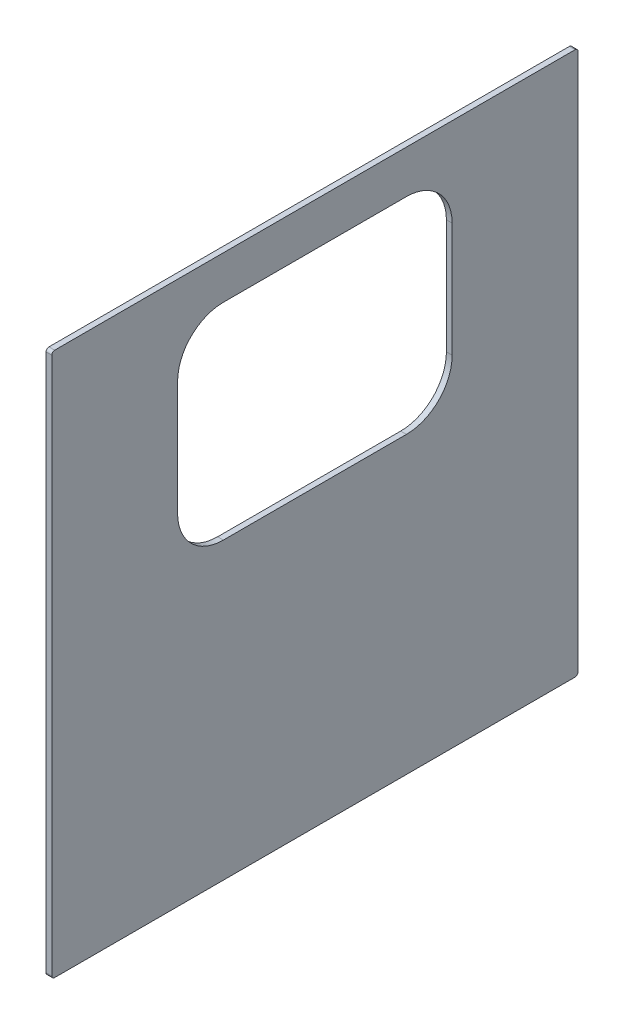
ISO-10303-21;
HEADER;
FILE_DESCRIPTION(('STEP AP214'),'2;1');
FILE_NAME('part.step','',(''),(''),'','','');
FILE_SCHEMA(('AUTOMOTIVE_DESIGN { 1 0 10303 214 1 1 1 1 }'));
ENDSEC;
DATA;
#1=APPLICATION_CONTEXT('core data for automotive mechanical design processes');
#2=APPLICATION_PROTOCOL_DEFINITION('international standard','automotive_design',2000,#1);
#3=PRODUCT_CONTEXT('',#1,'mechanical');
#4=PRODUCT('Part','Part','',(#3));
#5=PRODUCT_RELATED_PRODUCT_CATEGORY('part','',(#4));
#6=PRODUCT_DEFINITION_FORMATION('','',#4);
#7=PRODUCT_DEFINITION_CONTEXT('part definition',#1,'design');
#8=PRODUCT_DEFINITION('design','',#6,#7);
#9=PRODUCT_DEFINITION_SHAPE('','',#8);
#10=(LENGTH_UNIT() NAMED_UNIT(*) SI_UNIT(.MILLI.,.METRE.));
#11=(NAMED_UNIT(*) PLANE_ANGLE_UNIT() SI_UNIT($,.RADIAN.));
#12=(NAMED_UNIT(*) SI_UNIT($,.STERADIAN.) SOLID_ANGLE_UNIT());
#13=UNCERTAINTY_MEASURE_WITH_UNIT(LENGTH_MEASURE(1.E-05),#10,'distance_accuracy_value','');
#14=(GEOMETRIC_REPRESENTATION_CONTEXT(3) GLOBAL_UNCERTAINTY_ASSIGNED_CONTEXT((#13)) GLOBAL_UNIT_ASSIGNED_CONTEXT((#10,
#11,#12)) REPRESENTATION_CONTEXT('',''));
#15=CARTESIAN_POINT('',(0.,0.,0.));
#16=DIRECTION('',(0.,0.,1.));
#17=DIRECTION('',(1.,0.,0.));
#18=AXIS2_PLACEMENT_3D('',#15,#16,#17);
#19=CARTESIAN_POINT('',(12.7,6.35,-6.35));
#20=DIRECTION('',(1.,0.,0.));
#21=DIRECTION('',(0.,0.,-1.));
#22=AXIS2_PLACEMENT_3D('',#19,#20,#21);
#23=PLANE('',#22);
#24=CARTESIAN_POINT('',(12.7,6.35,-6.35));
#25=DIRECTION('',(1.,0.,0.));
#26=DIRECTION('',(0.,0.,-1.));
#27=AXIS2_PLACEMENT_3D('',#24,#25,#26);
#28=CIRCLE('',#27,6.35);
#29=CARTESIAN_POINT('',(12.7,6.35000000000004,0.));
#30=VERTEX_POINT('',#29);
#31=CARTESIAN_POINT('',(12.7,0.,-6.35000000000004));
#32=VERTEX_POINT('',#31);
#33=EDGE_CURVE('E278',#30,#32,#28,.T.);
#34=ORIENTED_EDGE('',*,*,#33,.T.);
#35=DIRECTION('',(0.,0.,-1.));
#36=VECTOR('',#35,1.);
#37=CARTESIAN_POINT('',(12.7,0.,-6.35000000000004));
#38=LINE('',#37,#36);
#39=CARTESIAN_POINT('',(12.7,0.,-1162.05));
#40=VERTEX_POINT('',#39);
#41=EDGE_CURVE('E282',#32,#40,#38,.T.);
#42=ORIENTED_EDGE('',*,*,#41,.T.);
#43=CARTESIAN_POINT('',(12.7,6.35,-1162.05));
#44=DIRECTION('',(1.,0.,0.));
#45=DIRECTION('',(0.,0.,-1.));
#46=AXIS2_PLACEMENT_3D('',#43,#44,#45);
#47=CIRCLE('',#46,6.34999999999993);
#48=CARTESIAN_POINT('',(12.7,6.35,-1168.4));
#49=VERTEX_POINT('',#48);
#50=EDGE_CURVE('E286',#40,#49,#47,.T.);
#51=ORIENTED_EDGE('',*,*,#50,.T.);
#52=DIRECTION('',(0.,1.,0.));
#53=VECTOR('',#52,1.);
#54=CARTESIAN_POINT('',(12.7,6.35,-1168.4));
#55=LINE('',#54,#53);
#56=CARTESIAN_POINT('',(12.7,1200.15,-1168.4));
#57=VERTEX_POINT('',#56);
#58=EDGE_CURVE('E289',#49,#57,#55,.T.);
#59=ORIENTED_EDGE('',*,*,#58,.T.);
#60=CARTESIAN_POINT('',(12.7,1200.15,-1162.05));
#61=DIRECTION('',(1.,0.,0.));
#62=DIRECTION('',(0.,0.,-1.));
#63=AXIS2_PLACEMENT_3D('',#60,#61,#62);
#64=CIRCLE('',#63,6.34999999999997);
#65=CARTESIAN_POINT('',(12.7,1206.5,-1162.05));
#66=VERTEX_POINT('',#65);
#67=EDGE_CURVE('E292',#57,#66,#64,.T.);
#68=ORIENTED_EDGE('',*,*,#67,.T.);
#69=DIRECTION('',(0.,0.,1.));
#70=VECTOR('',#69,1.);
#71=CARTESIAN_POINT('',(12.7,1206.5,-6.35));
#72=LINE('',#71,#70);
#73=CARTESIAN_POINT('',(12.7,1206.5,-6.35));
#74=VERTEX_POINT('',#73);
#75=EDGE_CURVE('E295',#66,#74,#72,.T.);
#76=ORIENTED_EDGE('',*,*,#75,.T.);
#77=CARTESIAN_POINT('',(12.7,1200.15,-6.35));
#78=DIRECTION('',(1.,0.,0.));
#79=DIRECTION('',(0.,0.,-1.));
#80=AXIS2_PLACEMENT_3D('',#77,#78,#79);
#81=CIRCLE('',#80,6.35000000000004);
#82=CARTESIAN_POINT('',(12.7,1200.15,0.));
#83=VERTEX_POINT('',#82);
#84=EDGE_CURVE('E298',#74,#83,#81,.T.);
#85=ORIENTED_EDGE('',*,*,#84,.T.);
#86=DIRECTION('',(0.,-1.,0.));
#87=VECTOR('',#86,1.);
#88=CARTESIAN_POINT('',(12.7,6.35000000000004,0.));
#89=LINE('',#88,#87);
#90=EDGE_CURVE('E301',#83,#30,#89,.T.);
#91=ORIENTED_EDGE('',*,*,#90,.T.);
#92=EDGE_LOOP('',(#34,#42,#51,#59,#68,#76,#85,#91));
#93=FACE_BOUND('',#92,.T.);
#94=DIRECTION('',(0.,0.,-1.));
#95=VECTOR('',#94,1.);
#96=CARTESIAN_POINT('',(12.7,654.05,-381.));
#97=LINE('',#96,#95);
#98=CARTESIAN_POINT('',(12.7,654.05,-381.));
#99=VERTEX_POINT('',#98);
#100=CARTESIAN_POINT('',(12.7,654.05,-787.4));
#101=VERTEX_POINT('',#100);
#102=EDGE_CURVE('E198',#99,#101,#97,.T.);
#103=ORIENTED_EDGE('',*,*,#102,.F.);
#104=CARTESIAN_POINT('',(12.7,755.65,-381.));
#105=DIRECTION('',(1.,0.,0.));
#106=DIRECTION('',(0.,0.,-1.));
#107=AXIS2_PLACEMENT_3D('',#104,#105,#106);
#108=CIRCLE('',#107,101.6);
#109=CARTESIAN_POINT('',(12.7,755.65,-279.4));
#110=VERTEX_POINT('',#109);
#111=EDGE_CURVE('E189',#110,#99,#108,.T.);
#112=ORIENTED_EDGE('',*,*,#111,.F.);
#113=DIRECTION('',(0.,-1.,0.));
#114=VECTOR('',#113,1.);
#115=CARTESIAN_POINT('',(12.7,1009.65,-279.4));
#116=LINE('',#115,#114);
#117=CARTESIAN_POINT('',(12.7,1009.65,-279.4));
#118=VERTEX_POINT('',#117);
#119=EDGE_CURVE('E231',#118,#110,#116,.T.);
#120=ORIENTED_EDGE('',*,*,#119,.F.);
#121=CARTESIAN_POINT('',(12.7,1009.65,-381.));
#122=DIRECTION('',(1.,0.,0.));
#123=DIRECTION('',(0.,0.,1.));
#124=AXIS2_PLACEMENT_3D('',#121,#122,#123);
#125=CIRCLE('',#124,101.6);
#126=CARTESIAN_POINT('',(12.7,1111.25,-381.));
#127=VERTEX_POINT('',#126);
#128=EDGE_CURVE('E228',#127,#118,#125,.T.);
#129=ORIENTED_EDGE('',*,*,#128,.F.);
#130=DIRECTION('',(0.,0.,1.));
#131=VECTOR('',#130,1.);
#132=CARTESIAN_POINT('',(12.7,1111.25,-381.));
#133=LINE('',#132,#131);
#134=CARTESIAN_POINT('',(12.7,1111.25,-787.4));
#135=VERTEX_POINT('',#134);
#136=EDGE_CURVE('E225',#135,#127,#133,.T.);
#137=ORIENTED_EDGE('',*,*,#136,.F.);
#138=CARTESIAN_POINT('',(12.7,1009.65,-787.4));
#139=DIRECTION('',(1.,0.,0.));
#140=DIRECTION('',(0.,0.,1.));
#141=AXIS2_PLACEMENT_3D('',#138,#139,#140);
#142=CIRCLE('',#141,101.6);
#143=CARTESIAN_POINT('',(12.7,1009.65,-889.));
#144=VERTEX_POINT('',#143);
#145=EDGE_CURVE('E222',#144,#135,#142,.T.);
#146=ORIENTED_EDGE('',*,*,#145,.F.);
#147=DIRECTION('',(0.,1.,0.));
#148=VECTOR('',#147,1.);
#149=CARTESIAN_POINT('',(12.7,1009.65,-889.));
#150=LINE('',#149,#148);
#151=CARTESIAN_POINT('',(12.7,755.65,-889.));
#152=VERTEX_POINT('',#151);
#153=EDGE_CURVE('E217',#152,#144,#150,.T.);
#154=ORIENTED_EDGE('',*,*,#153,.F.);
#155=CARTESIAN_POINT('',(12.7,755.65,-787.4));
#156=DIRECTION('',(1.,0.,0.));
#157=DIRECTION('',(0.,0.,1.));
#158=AXIS2_PLACEMENT_3D('',#155,#156,#157);
#159=CIRCLE('',#158,101.6);
#160=EDGE_CURVE('E212',#101,#152,#159,.T.);
#161=ORIENTED_EDGE('',*,*,#160,.F.);
#162=EDGE_LOOP('',(#103,#112,#120,#129,#137,#146,#154,#161));
#163=FACE_BOUND('',#162,.T.);
#164=ADVANCED_FACE('F39',(#93,#163),#23,.T.);
#165=CARTESIAN_POINT('',(0.,6.35,-6.35));
#166=DIRECTION('',(1.,0.,0.));
#167=DIRECTION('',(0.,0.,-1.));
#168=AXIS2_PLACEMENT_3D('',#165,#166,#167);
#169=PLANE('',#168);
#170=CARTESIAN_POINT('',(0.,6.35,-6.35));
#171=DIRECTION('',(1.,0.,0.));
#172=DIRECTION('',(0.,0.,-1.));
#173=AXIS2_PLACEMENT_3D('',#170,#171,#172);
#174=CIRCLE('',#173,6.35);
#175=CARTESIAN_POINT('',(0.,6.35000000000004,0.));
#176=VERTEX_POINT('',#175);
#177=CARTESIAN_POINT('',(0.,0.,-6.35000000000004));
#178=VERTEX_POINT('',#177);
#179=EDGE_CURVE('E207',#176,#178,#174,.T.);
#180=ORIENTED_EDGE('',*,*,#179,.F.);
#181=DIRECTION('',(0.,-1.,0.));
#182=VECTOR('',#181,1.);
#183=CARTESIAN_POINT('',(0.,6.35000000000004,0.));
#184=LINE('',#183,#182);
#185=CARTESIAN_POINT('',(0.,1200.15,0.));
#186=VERTEX_POINT('',#185);
#187=EDGE_CURVE('E283',#186,#176,#184,.T.);
#188=ORIENTED_EDGE('',*,*,#187,.F.);
#189=CARTESIAN_POINT('',(0.,1200.15,-6.35));
#190=DIRECTION('',(1.,0.,0.));
#191=DIRECTION('',(0.,0.,-1.));
#192=AXIS2_PLACEMENT_3D('',#189,#190,#191);
#193=CIRCLE('',#192,6.35000000000004);
#194=CARTESIAN_POINT('',(0.,1206.5,-6.35));
#195=VERTEX_POINT('',#194);
#196=EDGE_CURVE('E323',#195,#186,#193,.T.);
#197=ORIENTED_EDGE('',*,*,#196,.F.);
#198=DIRECTION('',(0.,0.,1.));
#199=VECTOR('',#198,1.);
#200=CARTESIAN_POINT('',(0.,1206.5,-6.35));
#201=LINE('',#200,#199);
#202=CARTESIAN_POINT('',(0.,1206.5,-1162.05));
#203=VERTEX_POINT('',#202);
#204=EDGE_CURVE('E320',#203,#195,#201,.T.);
#205=ORIENTED_EDGE('',*,*,#204,.F.);
#206=CARTESIAN_POINT('',(0.,1200.15,-1162.05));
#207=DIRECTION('',(1.,0.,0.));
#208=DIRECTION('',(0.,0.,-1.));
#209=AXIS2_PLACEMENT_3D('',#206,#207,#208);
#210=CIRCLE('',#209,6.34999999999997);
#211=CARTESIAN_POINT('',(0.,1200.15,-1168.4));
#212=VERTEX_POINT('',#211);
#213=EDGE_CURVE('E317',#212,#203,#210,.T.);
#214=ORIENTED_EDGE('',*,*,#213,.F.);
#215=DIRECTION('',(0.,1.,0.));
#216=VECTOR('',#215,1.);
#217=CARTESIAN_POINT('',(0.,6.35,-1168.4));
#218=LINE('',#217,#216);
#219=CARTESIAN_POINT('',(0.,6.35,-1168.4));
#220=VERTEX_POINT('',#219);
#221=EDGE_CURVE('E314',#220,#212,#218,.T.);
#222=ORIENTED_EDGE('',*,*,#221,.F.);
#223=CARTESIAN_POINT('',(0.,6.35,-1162.05));
#224=DIRECTION('',(1.,0.,0.));
#225=DIRECTION('',(0.,0.,-1.));
#226=AXIS2_PLACEMENT_3D('',#223,#224,#225);
#227=CIRCLE('',#226,6.34999999999993);
#228=CARTESIAN_POINT('',(0.,0.,-1162.05));
#229=VERTEX_POINT('',#228);
#230=EDGE_CURVE('E311',#229,#220,#227,.T.);
#231=ORIENTED_EDGE('',*,*,#230,.F.);
#232=DIRECTION('',(0.,0.,-1.));
#233=VECTOR('',#232,1.);
#234=CARTESIAN_POINT('',(0.,0.,-6.35000000000004));
#235=LINE('',#234,#233);
#236=EDGE_CURVE('E308',#178,#229,#235,.T.);
#237=ORIENTED_EDGE('',*,*,#236,.F.);
#238=EDGE_LOOP('',(#180,#188,#197,#205,#214,#222,#231,#237));
#239=FACE_BOUND('',#238,.T.);
#240=CARTESIAN_POINT('',(0.,755.65,-381.));
#241=DIRECTION('',(1.,0.,0.));
#242=DIRECTION('',(0.,0.,-1.));
#243=AXIS2_PLACEMENT_3D('',#240,#241,#242);
#244=CIRCLE('',#243,101.6);
#245=CARTESIAN_POINT('',(0.,755.65,-279.4));
#246=VERTEX_POINT('',#245);
#247=CARTESIAN_POINT('',(0.,654.05,-381.));
#248=VERTEX_POINT('',#247);
#249=EDGE_CURVE('E69',#246,#248,#244,.T.);
#250=ORIENTED_EDGE('',*,*,#249,.T.);
#251=DIRECTION('',(0.,0.,-1.));
#252=VECTOR('',#251,1.);
#253=CARTESIAN_POINT('',(0.,654.05,-381.));
#254=LINE('',#253,#252);
#255=CARTESIAN_POINT('',(0.,654.05,-787.4));
#256=VERTEX_POINT('',#255);
#257=EDGE_CURVE('E205',#248,#256,#254,.T.);
#258=ORIENTED_EDGE('',*,*,#257,.T.);
#259=CARTESIAN_POINT('',(0.,755.65,-787.4));
#260=DIRECTION('',(1.,0.,0.));
#261=DIRECTION('',(0.,0.,1.));
#262=AXIS2_PLACEMENT_3D('',#259,#260,#261);
#263=CIRCLE('',#262,101.6);
#264=CARTESIAN_POINT('',(0.,755.65,-889.));
#265=VERTEX_POINT('',#264);
#266=EDGE_CURVE('E237',#256,#265,#263,.T.);
#267=ORIENTED_EDGE('',*,*,#266,.T.);
#268=DIRECTION('',(0.,1.,0.));
#269=VECTOR('',#268,1.);
#270=CARTESIAN_POINT('',(0.,1009.65,-889.));
#271=LINE('',#270,#269);
#272=CARTESIAN_POINT('',(0.,1009.65,-889.));
#273=VERTEX_POINT('',#272);
#274=EDGE_CURVE('E241',#265,#273,#271,.T.);
#275=ORIENTED_EDGE('',*,*,#274,.T.);
#276=CARTESIAN_POINT('',(0.,1009.65,-787.4));
#277=DIRECTION('',(1.,0.,0.));
#278=DIRECTION('',(0.,0.,1.));
#279=AXIS2_PLACEMENT_3D('',#276,#277,#278);
#280=CIRCLE('',#279,101.6);
#281=CARTESIAN_POINT('',(0.,1111.25,-787.4));
#282=VERTEX_POINT('',#281);
#283=EDGE_CURVE('E245',#273,#282,#280,.T.);
#284=ORIENTED_EDGE('',*,*,#283,.T.);
#285=DIRECTION('',(0.,0.,1.));
#286=VECTOR('',#285,1.);
#287=CARTESIAN_POINT('',(0.,1111.25,-381.));
#288=LINE('',#287,#286);
#289=CARTESIAN_POINT('',(0.,1111.25,-381.));
#290=VERTEX_POINT('',#289);
#291=EDGE_CURVE('E249',#282,#290,#288,.T.);
#292=ORIENTED_EDGE('',*,*,#291,.T.);
#293=CARTESIAN_POINT('',(0.,1009.65,-381.));
#294=DIRECTION('',(1.,0.,0.));
#295=DIRECTION('',(0.,0.,1.));
#296=AXIS2_PLACEMENT_3D('',#293,#294,#295);
#297=CIRCLE('',#296,101.6);
#298=CARTESIAN_POINT('',(0.,1009.65,-279.4));
#299=VERTEX_POINT('',#298);
#300=EDGE_CURVE('E253',#290,#299,#297,.T.);
#301=ORIENTED_EDGE('',*,*,#300,.T.);
#302=DIRECTION('',(0.,-1.,0.));
#303=VECTOR('',#302,1.);
#304=CARTESIAN_POINT('',(0.,1009.65,-279.4));
#305=LINE('',#304,#303);
#306=EDGE_CURVE('E199',#299,#246,#305,.T.);
#307=ORIENTED_EDGE('',*,*,#306,.T.);
#308=EDGE_LOOP('',(#250,#258,#267,#275,#284,#292,#301,#307));
#309=FACE_BOUND('',#308,.T.);
#310=ADVANCED_FACE('F363',(#239,#309),#169,.F.);
#311=CARTESIAN_POINT('',(12.7,6.35,-6.35));
#312=DIRECTION('',(-1.,0.,0.));
#313=DIRECTION('',(0.,0.,1.));
#314=AXIS2_PLACEMENT_3D('',#311,#312,#313);
#315=CYLINDRICAL_SURFACE('',#314,6.35);
#316=ORIENTED_EDGE('',*,*,#179,.T.);
#317=DIRECTION('',(-1.,0.,0.));
#318=VECTOR('',#317,1.);
#319=CARTESIAN_POINT('',(12.7,0.,-6.35000000000004));
#320=LINE('',#319,#318);
#321=EDGE_CURVE('E11',#32,#178,#320,.T.);
#322=ORIENTED_EDGE('',*,*,#321,.F.);
#323=ORIENTED_EDGE('',*,*,#33,.F.);
#324=DIRECTION('',(-1.,0.,0.));
#325=VECTOR('',#324,1.);
#326=CARTESIAN_POINT('',(12.7,6.35000000000004,0.));
#327=LINE('',#326,#325);
#328=EDGE_CURVE('E304',#30,#176,#327,.T.);
#329=ORIENTED_EDGE('',*,*,#328,.T.);
#330=EDGE_LOOP('',(#316,#322,#323,#329));
#331=FACE_BOUND('',#330,.T.);
#332=ADVANCED_FACE('F41',(#331),#315,.T.);
#333=CARTESIAN_POINT('',(12.7,0.,-6.35000000000004));
#334=DIRECTION('',(0.,1.,0.));
#335=DIRECTION('',(0.,0.,1.));
#336=AXIS2_PLACEMENT_3D('',#333,#334,#335);
#337=PLANE('',#336);
#338=ORIENTED_EDGE('',*,*,#236,.T.);
#339=DIRECTION('',(-1.,0.,0.));
#340=VECTOR('',#339,1.);
#341=CARTESIAN_POINT('',(12.7,0.,-1162.05));
#342=LINE('',#341,#340);
#343=EDGE_CURVE('E48',#40,#229,#342,.T.);
#344=ORIENTED_EDGE('',*,*,#343,.F.);
#345=ORIENTED_EDGE('',*,*,#41,.F.);
#346=ORIENTED_EDGE('',*,*,#321,.T.);
#347=EDGE_LOOP('',(#338,#344,#345,#346));
#348=FACE_BOUND('',#347,.T.);
#349=ADVANCED_FACE('F380',(#348),#337,.F.);
#350=CARTESIAN_POINT('',(12.7,6.35,-1162.05));
#351=DIRECTION('',(-1.,0.,0.));
#352=DIRECTION('',(0.,0.,1.));
#353=AXIS2_PLACEMENT_3D('',#350,#351,#352);
#354=CYLINDRICAL_SURFACE('',#353,6.34999999999993);
#355=ORIENTED_EDGE('',*,*,#230,.T.);
#356=DIRECTION('',(-1.,0.,0.));
#357=VECTOR('',#356,1.);
#358=CARTESIAN_POINT('',(12.7,6.35,-1168.4));
#359=LINE('',#358,#357);
#360=EDGE_CURVE('E347',#49,#220,#359,.T.);
#361=ORIENTED_EDGE('',*,*,#360,.F.);
#362=ORIENTED_EDGE('',*,*,#50,.F.);
#363=ORIENTED_EDGE('',*,*,#343,.T.);
#364=EDGE_LOOP('',(#355,#361,#362,#363));
#365=FACE_BOUND('',#364,.T.);
#366=ADVANCED_FACE('F357',(#365),#354,.T.);
#367=CARTESIAN_POINT('',(12.7,6.35,-1168.4));
#368=DIRECTION('',(0.,0.,1.));
#369=DIRECTION('',(0.,-1.,0.));
#370=AXIS2_PLACEMENT_3D('',#367,#368,#369);
#371=PLANE('',#370);
#372=ORIENTED_EDGE('',*,*,#221,.T.);
#373=DIRECTION('',(-1.,0.,0.));
#374=VECTOR('',#373,1.);
#375=CARTESIAN_POINT('',(12.7,1200.15,-1168.4));
#376=LINE('',#375,#374);
#377=EDGE_CURVE('E343',#57,#212,#376,.T.);
#378=ORIENTED_EDGE('',*,*,#377,.F.);
#379=ORIENTED_EDGE('',*,*,#58,.F.);
#380=ORIENTED_EDGE('',*,*,#360,.T.);
#381=EDGE_LOOP('',(#372,#378,#379,#380));
#382=FACE_BOUND('',#381,.T.);
#383=ADVANCED_FACE('F369',(#382),#371,.F.);
#384=CARTESIAN_POINT('',(12.7,1200.15,-1162.05));
#385=DIRECTION('',(-1.,0.,0.));
#386=DIRECTION('',(0.,0.,1.));
#387=AXIS2_PLACEMENT_3D('',#384,#385,#386);
#388=CYLINDRICAL_SURFACE('',#387,6.34999999999997);
#389=ORIENTED_EDGE('',*,*,#213,.T.);
#390=DIRECTION('',(-1.,0.,0.));
#391=VECTOR('',#390,1.);
#392=CARTESIAN_POINT('',(12.7,1206.5,-1162.05));
#393=LINE('',#392,#391);
#394=EDGE_CURVE('E339',#66,#203,#393,.T.);
#395=ORIENTED_EDGE('',*,*,#394,.F.);
#396=ORIENTED_EDGE('',*,*,#67,.F.);
#397=ORIENTED_EDGE('',*,*,#377,.T.);
#398=EDGE_LOOP('',(#389,#395,#396,#397));
#399=FACE_BOUND('',#398,.T.);
#400=ADVANCED_FACE('F373',(#399),#388,.T.);
#401=CARTESIAN_POINT('',(12.7,1206.5,-6.35));
#402=DIRECTION('',(0.,-1.,0.));
#403=DIRECTION('',(0.,0.,-1.));
#404=AXIS2_PLACEMENT_3D('',#401,#402,#403);
#405=PLANE('',#404);
#406=ORIENTED_EDGE('',*,*,#204,.T.);
#407=DIRECTION('',(-1.,0.,0.));
#408=VECTOR('',#407,1.);
#409=CARTESIAN_POINT('',(12.7,1206.5,-6.35));
#410=LINE('',#409,#408);
#411=EDGE_CURVE('E335',#74,#195,#410,.T.);
#412=ORIENTED_EDGE('',*,*,#411,.F.);
#413=ORIENTED_EDGE('',*,*,#75,.F.);
#414=ORIENTED_EDGE('',*,*,#394,.T.);
#415=EDGE_LOOP('',(#406,#412,#413,#414));
#416=FACE_BOUND('',#415,.T.);
#417=ADVANCED_FACE('F393',(#416),#405,.F.);
#418=CARTESIAN_POINT('',(12.7,1200.15,-6.35));
#419=DIRECTION('',(-1.,0.,0.));
#420=DIRECTION('',(0.,0.,1.));
#421=AXIS2_PLACEMENT_3D('',#418,#419,#420);
#422=CYLINDRICAL_SURFACE('',#421,6.35000000000004);
#423=ORIENTED_EDGE('',*,*,#196,.T.);
#424=DIRECTION('',(-1.,0.,0.));
#425=VECTOR('',#424,1.);
#426=CARTESIAN_POINT('',(12.7,1200.15,0.));
#427=LINE('',#426,#425);
#428=EDGE_CURVE('E331',#83,#186,#427,.T.);
#429=ORIENTED_EDGE('',*,*,#428,.F.);
#430=ORIENTED_EDGE('',*,*,#84,.F.);
#431=ORIENTED_EDGE('',*,*,#411,.T.);
#432=EDGE_LOOP('',(#423,#429,#430,#431));
#433=FACE_BOUND('',#432,.T.);
#434=ADVANCED_FACE('F391',(#433),#422,.T.);
#435=CARTESIAN_POINT('',(12.7,6.35000000000004,0.));
#436=DIRECTION('',(0.,0.,-1.));
#437=DIRECTION('',(0.,1.,0.));
#438=AXIS2_PLACEMENT_3D('',#435,#436,#437);
#439=PLANE('',#438);
#440=ORIENTED_EDGE('',*,*,#187,.T.);
#441=ORIENTED_EDGE('',*,*,#328,.F.);
#442=ORIENTED_EDGE('',*,*,#90,.F.);
#443=ORIENTED_EDGE('',*,*,#428,.T.);
#444=EDGE_LOOP('',(#440,#441,#442,#443));
#445=FACE_BOUND('',#444,.T.);
#446=ADVANCED_FACE('F386',(#445),#439,.F.);
#447=CARTESIAN_POINT('',(12.7,755.65,-381.));
#448=DIRECTION('',(-1.,0.,0.));
#449=DIRECTION('',(0.,0.,1.));
#450=AXIS2_PLACEMENT_3D('',#447,#448,#449);
#451=CYLINDRICAL_SURFACE('',#450,101.6);
#452=ORIENTED_EDGE('',*,*,#249,.F.);
#453=DIRECTION('',(-1.,0.,0.));
#454=VECTOR('',#453,1.);
#455=CARTESIAN_POINT('',(12.7,755.65,-279.4));
#456=LINE('',#455,#454);
#457=EDGE_CURVE('E193',#110,#246,#456,.T.);
#458=ORIENTED_EDGE('',*,*,#457,.F.);
#459=ORIENTED_EDGE('',*,*,#111,.T.);
#460=DIRECTION('',(-1.,0.,0.));
#461=VECTOR('',#460,1.);
#462=CARTESIAN_POINT('',(12.7,654.05,-381.));
#463=LINE('',#462,#461);
#464=EDGE_CURVE('E192',#99,#248,#463,.T.);
#465=ORIENTED_EDGE('',*,*,#464,.T.);
#466=EDGE_LOOP('',(#452,#458,#459,#465));
#467=FACE_BOUND('',#466,.T.);
#468=ADVANCED_FACE('F191',(#467),#451,.F.);
#469=CARTESIAN_POINT('',(12.7,654.05,-381.));
#470=DIRECTION('',(0.,1.,0.));
#471=DIRECTION('',(0.,0.,1.));
#472=AXIS2_PLACEMENT_3D('',#469,#470,#471);
#473=PLANE('',#472);
#474=ORIENTED_EDGE('',*,*,#257,.F.);
#475=ORIENTED_EDGE('',*,*,#464,.F.);
#476=ORIENTED_EDGE('',*,*,#102,.T.);
#477=DIRECTION('',(-1.,0.,0.));
#478=VECTOR('',#477,1.);
#479=CARTESIAN_POINT('',(12.7,654.05,-787.4));
#480=LINE('',#479,#478);
#481=EDGE_CURVE('E208',#101,#256,#480,.T.);
#482=ORIENTED_EDGE('',*,*,#481,.T.);
#483=EDGE_LOOP('',(#474,#475,#476,#482));
#484=FACE_BOUND('',#483,.T.);
#485=ADVANCED_FACE('F202',(#484),#473,.T.);
#486=CARTESIAN_POINT('',(12.7,755.65,-787.4));
#487=DIRECTION('',(-1.,0.,0.));
#488=DIRECTION('',(0.,0.,1.));
#489=AXIS2_PLACEMENT_3D('',#486,#487,#488);
#490=CYLINDRICAL_SURFACE('',#489,101.6);
#491=ORIENTED_EDGE('',*,*,#266,.F.);
#492=ORIENTED_EDGE('',*,*,#481,.F.);
#493=ORIENTED_EDGE('',*,*,#160,.T.);
#494=DIRECTION('',(-1.,0.,0.));
#495=VECTOR('',#494,1.);
#496=CARTESIAN_POINT('',(12.7,755.65,-889.));
#497=LINE('',#496,#495);
#498=EDGE_CURVE('E273',#152,#265,#497,.T.);
#499=ORIENTED_EDGE('',*,*,#498,.T.);
#500=EDGE_LOOP('',(#491,#492,#493,#499));
#501=FACE_BOUND('',#500,.T.);
#502=ADVANCED_FACE('F418',(#501),#490,.F.);
#503=CARTESIAN_POINT('',(12.7,1009.65,-889.));
#504=DIRECTION('',(0.,0.,1.));
#505=DIRECTION('',(0.,-1.,0.));
#506=AXIS2_PLACEMENT_3D('',#503,#504,#505);
#507=PLANE('',#506);
#508=ORIENTED_EDGE('',*,*,#274,.F.);
#509=ORIENTED_EDGE('',*,*,#498,.F.);
#510=ORIENTED_EDGE('',*,*,#153,.T.);
#511=DIRECTION('',(-1.,0.,0.));
#512=VECTOR('',#511,1.);
#513=CARTESIAN_POINT('',(12.7,1009.65,-889.));
#514=LINE('',#513,#512);
#515=EDGE_CURVE('E270',#144,#273,#514,.T.);
#516=ORIENTED_EDGE('',*,*,#515,.T.);
#517=EDGE_LOOP('',(#508,#509,#510,#516));
#518=FACE_BOUND('',#517,.T.);
#519=ADVANCED_FACE('F422',(#518),#507,.T.);
#520=CARTESIAN_POINT('',(12.7,1009.65,-787.4));
#521=DIRECTION('',(-1.,0.,0.));
#522=DIRECTION('',(0.,0.,1.));
#523=AXIS2_PLACEMENT_3D('',#520,#521,#522);
#524=CYLINDRICAL_SURFACE('',#523,101.6);
#525=ORIENTED_EDGE('',*,*,#283,.F.);
#526=ORIENTED_EDGE('',*,*,#515,.F.);
#527=ORIENTED_EDGE('',*,*,#145,.T.);
#528=DIRECTION('',(-1.,0.,0.));
#529=VECTOR('',#528,1.);
#530=CARTESIAN_POINT('',(12.7,1111.25,-787.4));
#531=LINE('',#530,#529);
#532=EDGE_CURVE('E267',#135,#282,#531,.T.);
#533=ORIENTED_EDGE('',*,*,#532,.T.);
#534=EDGE_LOOP('',(#525,#526,#527,#533));
#535=FACE_BOUND('',#534,.T.);
#536=ADVANCED_FACE('F428',(#535),#524,.F.);
#537=CARTESIAN_POINT('',(12.7,1111.25,-381.));
#538=DIRECTION('',(0.,-1.,0.));
#539=DIRECTION('',(0.,0.,-1.));
#540=AXIS2_PLACEMENT_3D('',#537,#538,#539);
#541=PLANE('',#540);
#542=ORIENTED_EDGE('',*,*,#291,.F.);
#543=ORIENTED_EDGE('',*,*,#532,.F.);
#544=ORIENTED_EDGE('',*,*,#136,.T.);
#545=DIRECTION('',(-1.,0.,0.));
#546=VECTOR('',#545,1.);
#547=CARTESIAN_POINT('',(12.7,1111.25,-381.));
#548=LINE('',#547,#546);
#549=EDGE_CURVE('E264',#127,#290,#548,.T.);
#550=ORIENTED_EDGE('',*,*,#549,.T.);
#551=EDGE_LOOP('',(#542,#543,#544,#550));
#552=FACE_BOUND('',#551,.T.);
#553=ADVANCED_FACE('F432',(#552),#541,.T.);
#554=CARTESIAN_POINT('',(12.7,1009.65,-381.));
#555=DIRECTION('',(-1.,0.,0.));
#556=DIRECTION('',(0.,0.,1.));
#557=AXIS2_PLACEMENT_3D('',#554,#555,#556);
#558=CYLINDRICAL_SURFACE('',#557,101.6);
#559=ORIENTED_EDGE('',*,*,#300,.F.);
#560=ORIENTED_EDGE('',*,*,#549,.F.);
#561=ORIENTED_EDGE('',*,*,#128,.T.);
#562=DIRECTION('',(-1.,0.,0.));
#563=VECTOR('',#562,1.);
#564=CARTESIAN_POINT('',(12.7,1009.65,-279.4));
#565=LINE('',#564,#563);
#566=EDGE_CURVE('E59',#118,#299,#565,.T.);
#567=ORIENTED_EDGE('',*,*,#566,.T.);
#568=EDGE_LOOP('',(#559,#560,#561,#567));
#569=FACE_BOUND('',#568,.T.);
#570=ADVANCED_FACE('F436',(#569),#558,.F.);
#571=CARTESIAN_POINT('',(12.7,1009.65,-279.4));
#572=DIRECTION('',(0.,0.,-1.));
#573=DIRECTION('',(-1.,0.,0.));
#574=AXIS2_PLACEMENT_3D('',#571,#572,#573);
#575=PLANE('',#574);
#576=ORIENTED_EDGE('',*,*,#306,.F.);
#577=ORIENTED_EDGE('',*,*,#566,.F.);
#578=ORIENTED_EDGE('',*,*,#119,.T.);
#579=ORIENTED_EDGE('',*,*,#457,.T.);
#580=EDGE_LOOP('',(#576,#577,#578,#579));
#581=FACE_BOUND('',#580,.T.);
#582=ADVANCED_FACE('F440',(#581),#575,.T.);
#583=CLOSED_SHELL('',(#164,#310,#332,#349,#366,#383,#400,#417,#434,#446,#468,#485,#502,#519,
#536,#553,#570,#582));
#584=MANIFOLD_SOLID_BREP('B2',#583);
#585=ADVANCED_BREP_SHAPE_REPRESENTATION('',(#18,#584),#14);
#586=SHAPE_DEFINITION_REPRESENTATION(#9,#585);
ENDSEC;
END-ISO-10303-21;
